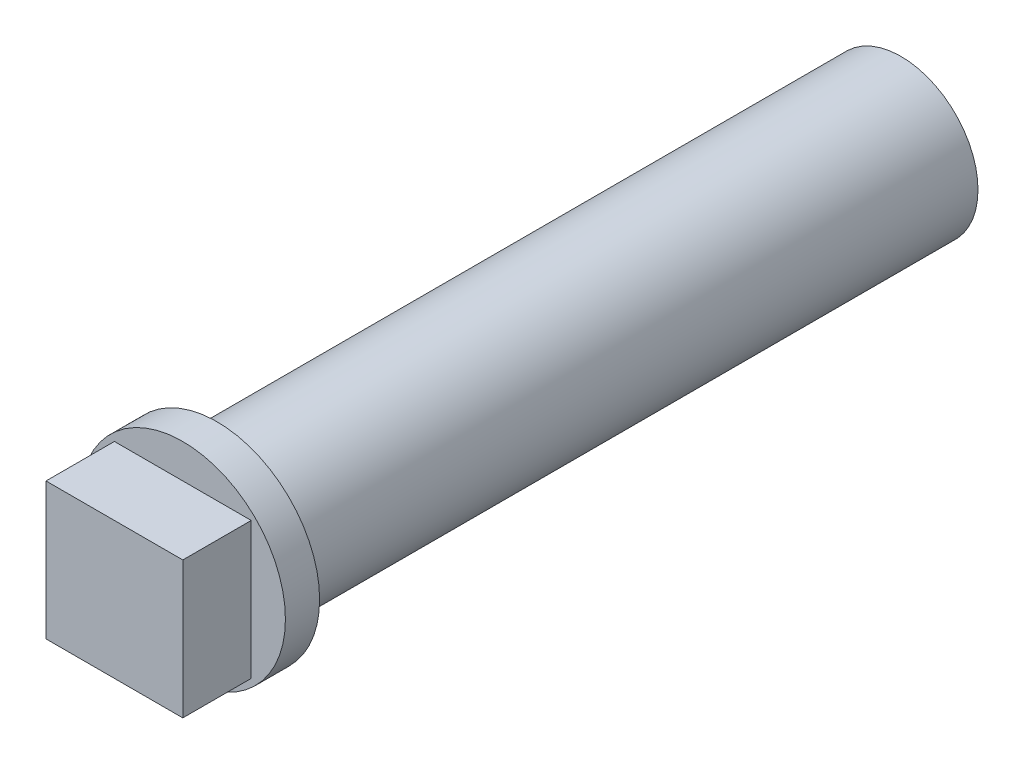
ISO-10303-21;
HEADER;
FILE_DESCRIPTION(('STEP AP214'),'2;1');
FILE_NAME('part.step','',(''),(''),'','','');
FILE_SCHEMA(('AUTOMOTIVE_DESIGN { 1 0 10303 214 1 1 1 1 }'));
ENDSEC;
DATA;
#1=APPLICATION_CONTEXT('core data for automotive mechanical design processes');
#2=APPLICATION_PROTOCOL_DEFINITION('international standard','automotive_design',2000,#1);
#3=PRODUCT_CONTEXT('',#1,'mechanical');
#4=PRODUCT('Part','Part','',(#3));
#5=PRODUCT_RELATED_PRODUCT_CATEGORY('part','',(#4));
#6=PRODUCT_DEFINITION_FORMATION('','',#4);
#7=PRODUCT_DEFINITION_CONTEXT('part definition',#1,'design');
#8=PRODUCT_DEFINITION('design','',#6,#7);
#9=PRODUCT_DEFINITION_SHAPE('','',#8);
#10=(LENGTH_UNIT() NAMED_UNIT(*) SI_UNIT(.MILLI.,.METRE.));
#11=(NAMED_UNIT(*) PLANE_ANGLE_UNIT() SI_UNIT($,.RADIAN.));
#12=(NAMED_UNIT(*) SI_UNIT($,.STERADIAN.) SOLID_ANGLE_UNIT());
#13=UNCERTAINTY_MEASURE_WITH_UNIT(LENGTH_MEASURE(1.E-05),#10,'distance_accuracy_value','');
#14=(GEOMETRIC_REPRESENTATION_CONTEXT(3) GLOBAL_UNCERTAINTY_ASSIGNED_CONTEXT((#13)) GLOBAL_UNIT_ASSIGNED_CONTEXT((#10,
#11,#12)) REPRESENTATION_CONTEXT('',''));
#15=CARTESIAN_POINT('',(0.,0.,0.));
#16=DIRECTION('',(0.,0.,1.));
#17=DIRECTION('',(1.,0.,0.));
#18=AXIS2_PLACEMENT_3D('',#15,#16,#17);
#19=CARTESIAN_POINT('',(0.,0.,20.));
#20=DIRECTION('',(0.,0.,-1.));
#21=DIRECTION('',(-1.,0.,0.));
#22=AXIS2_PLACEMENT_3D('',#19,#20,#21);
#23=CYLINDRICAL_SURFACE('',#22,2.25);
#24=CARTESIAN_POINT('',(0.,0.,20.));
#25=DIRECTION('',(0.,0.,1.));
#26=DIRECTION('',(1.,0.,0.));
#27=AXIS2_PLACEMENT_3D('',#24,#25,#26);
#28=CIRCLE('',#27,2.25);
#29=CARTESIAN_POINT('',(2.25,0.,20.));
#30=VERTEX_POINT('',#29);
#31=EDGE_CURVE('E11',#30,#30,#28,.T.);
#32=ORIENTED_EDGE('',*,*,#31,.F.);
#33=EDGE_LOOP('',(#32));
#34=FACE_BOUND('',#33,.T.);
#35=CARTESIAN_POINT('',(0.,0.,0.));
#36=DIRECTION('',(0.,0.,1.));
#37=DIRECTION('',(1.,0.,0.));
#38=AXIS2_PLACEMENT_3D('',#35,#36,#37);
#39=CIRCLE('',#38,2.25);
#40=CARTESIAN_POINT('',(2.25,0.,0.));
#41=VERTEX_POINT('',#40);
#42=EDGE_CURVE('E44',#41,#41,#39,.T.);
#43=ORIENTED_EDGE('',*,*,#42,.T.);
#44=EDGE_LOOP('',(#43));
#45=FACE_BOUND('',#44,.T.);
#46=ADVANCED_FACE('F41',(#34,#45),#23,.T.);
#47=CARTESIAN_POINT('',(0.,0.,0.));
#48=DIRECTION('',(0.,0.,1.));
#49=DIRECTION('',(1.,0.,0.));
#50=AXIS2_PLACEMENT_3D('',#47,#48,#49);
#51=PLANE('',#50);
#52=DIRECTION('',(-1.,0.,0.));
#53=VECTOR('',#52,1.);
#54=CARTESIAN_POINT('',(0.,-1.2,0.));
#55=LINE('',#54,#53);
#56=CARTESIAN_POINT('',(1.2,-1.2,0.));
#57=VERTEX_POINT('',#56);
#58=CARTESIAN_POINT('',(-1.2,-1.2,0.));
#59=VERTEX_POINT('',#58);
#60=EDGE_CURVE('E164',#57,#59,#55,.T.);
#61=ORIENTED_EDGE('',*,*,#60,.F.);
#62=DIRECTION('',(0.,-1.,0.));
#63=VECTOR('',#62,1.);
#64=CARTESIAN_POINT('',(1.2,0.,0.));
#65=LINE('',#64,#63);
#66=CARTESIAN_POINT('',(1.2,1.2,0.));
#67=VERTEX_POINT('',#66);
#68=EDGE_CURVE('E142',#67,#57,#65,.T.);
#69=ORIENTED_EDGE('',*,*,#68,.F.);
#70=DIRECTION('',(1.,0.,0.));
#71=VECTOR('',#70,1.);
#72=CARTESIAN_POINT('',(0.,1.2,0.));
#73=LINE('',#72,#71);
#74=CARTESIAN_POINT('',(-1.2,1.2,0.));
#75=VERTEX_POINT('',#74);
#76=EDGE_CURVE('E149',#75,#67,#73,.T.);
#77=ORIENTED_EDGE('',*,*,#76,.F.);
#78=DIRECTION('',(0.,1.,0.));
#79=VECTOR('',#78,1.);
#80=CARTESIAN_POINT('',(-1.2,0.,0.));
#81=LINE('',#80,#79);
#82=EDGE_CURVE('E168',#59,#75,#81,.T.);
#83=ORIENTED_EDGE('',*,*,#82,.F.);
#84=EDGE_LOOP('',(#61,#69,#77,#83));
#85=FACE_BOUND('',#84,.T.);
#86=ORIENTED_EDGE('',*,*,#42,.F.);
#87=EDGE_LOOP('',(#86));
#88=FACE_BOUND('',#87,.T.);
#89=ADVANCED_FACE('F195',(#85,#88),#51,.F.);
#90=CARTESIAN_POINT('',(1.2,0.,2.5));
#91=DIRECTION('',(1.,0.,0.));
#92=DIRECTION('',(0.,0.,-1.));
#93=AXIS2_PLACEMENT_3D('',#90,#91,#92);
#94=PLANE('',#93);
#95=ORIENTED_EDGE('',*,*,#68,.T.);
#96=DIRECTION('',(0.,0.,-1.));
#97=VECTOR('',#96,1.);
#98=CARTESIAN_POINT('',(1.2,-1.2,2.5));
#99=LINE('',#98,#97);
#100=CARTESIAN_POINT('',(1.2,-1.2,2.5));
#101=VERTEX_POINT('',#100);
#102=EDGE_CURVE('E161',#101,#57,#99,.T.);
#103=ORIENTED_EDGE('',*,*,#102,.F.);
#104=DIRECTION('',(0.,-1.,0.));
#105=VECTOR('',#104,1.);
#106=CARTESIAN_POINT('',(1.2,0.,2.5));
#107=LINE('',#106,#105);
#108=CARTESIAN_POINT('',(1.2,1.2,2.5));
#109=VERTEX_POINT('',#108);
#110=EDGE_CURVE('E144',#109,#101,#107,.T.);
#111=ORIENTED_EDGE('',*,*,#110,.F.);
#112=DIRECTION('',(0.,0.,-1.));
#113=VECTOR('',#112,1.);
#114=CARTESIAN_POINT('',(1.2,1.2,2.5));
#115=LINE('',#114,#113);
#116=EDGE_CURVE('E175',#109,#67,#115,.T.);
#117=ORIENTED_EDGE('',*,*,#116,.T.);
#118=EDGE_LOOP('',(#95,#103,#111,#117));
#119=FACE_BOUND('',#118,.T.);
#120=ADVANCED_FACE('F204',(#119),#94,.F.);
#121=CARTESIAN_POINT('',(0.,1.2,2.5));
#122=DIRECTION('',(0.,1.,0.));
#123=DIRECTION('',(-1.,0.,0.));
#124=AXIS2_PLACEMENT_3D('',#121,#122,#123);
#125=PLANE('',#124);
#126=ORIENTED_EDGE('',*,*,#76,.T.);
#127=ORIENTED_EDGE('',*,*,#116,.F.);
#128=DIRECTION('',(1.,0.,0.));
#129=VECTOR('',#128,1.);
#130=CARTESIAN_POINT('',(0.,1.2,2.5));
#131=LINE('',#130,#129);
#132=CARTESIAN_POINT('',(-1.2,1.2,2.5));
#133=VERTEX_POINT('',#132);
#134=EDGE_CURVE('E157',#133,#109,#131,.T.);
#135=ORIENTED_EDGE('',*,*,#134,.F.);
#136=DIRECTION('',(0.,0.,-1.));
#137=VECTOR('',#136,1.);
#138=CARTESIAN_POINT('',(-1.2,1.2,2.5));
#139=LINE('',#138,#137);
#140=EDGE_CURVE('E178',#133,#75,#139,.T.);
#141=ORIENTED_EDGE('',*,*,#140,.T.);
#142=EDGE_LOOP('',(#126,#127,#135,#141));
#143=FACE_BOUND('',#142,.T.);
#144=ADVANCED_FACE('F206',(#143),#125,.F.);
#145=CARTESIAN_POINT('',(-1.2,0.,2.5));
#146=DIRECTION('',(-1.,0.,0.));
#147=DIRECTION('',(0.,0.,1.));
#148=AXIS2_PLACEMENT_3D('',#145,#146,#147);
#149=PLANE('',#148);
#150=ORIENTED_EDGE('',*,*,#82,.T.);
#151=ORIENTED_EDGE('',*,*,#140,.F.);
#152=DIRECTION('',(0.,1.,0.));
#153=VECTOR('',#152,1.);
#154=CARTESIAN_POINT('',(-1.2,0.,2.5));
#155=LINE('',#154,#153);
#156=CARTESIAN_POINT('',(-1.2,-1.2,2.5));
#157=VERTEX_POINT('',#156);
#158=EDGE_CURVE('E153',#157,#133,#155,.T.);
#159=ORIENTED_EDGE('',*,*,#158,.F.);
#160=DIRECTION('',(0.,0.,-1.));
#161=VECTOR('',#160,1.);
#162=CARTESIAN_POINT('',(-1.2,-1.2,2.5));
#163=LINE('',#162,#161);
#164=EDGE_CURVE('E181',#157,#59,#163,.T.);
#165=ORIENTED_EDGE('',*,*,#164,.T.);
#166=EDGE_LOOP('',(#150,#151,#159,#165));
#167=FACE_BOUND('',#166,.T.);
#168=ADVANCED_FACE('F199',(#167),#149,.F.);
#169=CARTESIAN_POINT('',(0.,-1.2,2.5));
#170=DIRECTION('',(0.,-1.,0.));
#171=DIRECTION('',(1.,0.,0.));
#172=AXIS2_PLACEMENT_3D('',#169,#170,#171);
#173=PLANE('',#172);
#174=ORIENTED_EDGE('',*,*,#60,.T.);
#175=ORIENTED_EDGE('',*,*,#164,.F.);
#176=DIRECTION('',(-1.,0.,0.));
#177=VECTOR('',#176,1.);
#178=CARTESIAN_POINT('',(0.,-1.2,2.5));
#179=LINE('',#178,#177);
#180=EDGE_CURVE('E148',#101,#157,#179,.T.);
#181=ORIENTED_EDGE('',*,*,#180,.F.);
#182=ORIENTED_EDGE('',*,*,#102,.T.);
#183=EDGE_LOOP('',(#174,#175,#181,#182));
#184=FACE_BOUND('',#183,.T.);
#185=ADVANCED_FACE('F189',(#184),#173,.F.);
#186=CARTESIAN_POINT('',(0.,0.,2.5));
#187=DIRECTION('',(0.,0.,-1.));
#188=DIRECTION('',(-1.,0.,0.));
#189=AXIS2_PLACEMENT_3D('',#186,#187,#188);
#190=PLANE('',#189);
#191=ORIENTED_EDGE('',*,*,#110,.T.);
#192=ORIENTED_EDGE('',*,*,#180,.T.);
#193=ORIENTED_EDGE('',*,*,#158,.T.);
#194=ORIENTED_EDGE('',*,*,#134,.T.);
#195=EDGE_LOOP('',(#191,#192,#193,#194));
#196=FACE_BOUND('',#195,.T.);
#197=ADVANCED_FACE('F203',(#196),#190,.T.);
#198=CARTESIAN_POINT('',(0.,0.,21.));
#199=DIRECTION('',(0.,0.,-1.));
#200=DIRECTION('',(-1.,0.,0.));
#201=AXIS2_PLACEMENT_3D('',#198,#199,#200);
#202=CYLINDRICAL_SURFACE('',#201,3.);
#203=CARTESIAN_POINT('',(0.,0.,21.));
#204=DIRECTION('',(0.,0.,1.));
#205=DIRECTION('',(1.,0.,0.));
#206=AXIS2_PLACEMENT_3D('',#203,#204,#205);
#207=CIRCLE('',#206,3.);
#208=CARTESIAN_POINT('',(3.,0.,21.));
#209=VERTEX_POINT('',#208);
#210=EDGE_CURVE('E134',#209,#209,#207,.T.);
#211=ORIENTED_EDGE('',*,*,#210,.F.);
#212=EDGE_LOOP('',(#211));
#213=FACE_BOUND('',#212,.T.);
#214=CARTESIAN_POINT('',(0.,0.,20.));
#215=DIRECTION('',(0.,0.,1.));
#216=DIRECTION('',(1.,0.,0.));
#217=AXIS2_PLACEMENT_3D('',#214,#215,#216);
#218=CIRCLE('',#217,3.);
#219=CARTESIAN_POINT('',(3.,0.,20.));
#220=VERTEX_POINT('',#219);
#221=EDGE_CURVE('E129',#220,#220,#218,.T.);
#222=ORIENTED_EDGE('',*,*,#221,.T.);
#223=EDGE_LOOP('',(#222));
#224=FACE_BOUND('',#223,.T.);
#225=ADVANCED_FACE('F234',(#213,#224),#202,.T.);
#226=CARTESIAN_POINT('',(0.,0.,21.));
#227=DIRECTION('',(0.,0.,1.));
#228=DIRECTION('',(1.,0.,0.));
#229=AXIS2_PLACEMENT_3D('',#226,#227,#228);
#230=PLANE('',#229);
#231=DIRECTION('',(0.,-1.,0.));
#232=VECTOR('',#231,1.);
#233=CARTESIAN_POINT('',(-2.,-2.,21.));
#234=LINE('',#233,#232);
#235=CARTESIAN_POINT('',(-2.,2.,21.));
#236=VERTEX_POINT('',#235);
#237=CARTESIAN_POINT('',(-2.,-2.,21.));
#238=VERTEX_POINT('',#237);
#239=EDGE_CURVE('E56',#236,#238,#234,.T.);
#240=ORIENTED_EDGE('',*,*,#239,.F.);
#241=DIRECTION('',(-1.,0.,0.));
#242=VECTOR('',#241,1.);
#243=CARTESIAN_POINT('',(2.,2.,21.));
#244=LINE('',#243,#242);
#245=CARTESIAN_POINT('',(2.,2.,21.));
#246=VERTEX_POINT('',#245);
#247=EDGE_CURVE('E60',#246,#236,#244,.T.);
#248=ORIENTED_EDGE('',*,*,#247,.F.);
#249=DIRECTION('',(0.,1.,0.));
#250=VECTOR('',#249,1.);
#251=CARTESIAN_POINT('',(2.,-2.,21.));
#252=LINE('',#251,#250);
#253=CARTESIAN_POINT('',(2.,-2.,21.));
#254=VERTEX_POINT('',#253);
#255=EDGE_CURVE('E348',#254,#246,#252,.T.);
#256=ORIENTED_EDGE('',*,*,#255,.F.);
#257=DIRECTION('',(1.,0.,0.));
#258=VECTOR('',#257,1.);
#259=CARTESIAN_POINT('',(2.,-2.,21.));
#260=LINE('',#259,#258);
#261=EDGE_CURVE('E358',#238,#254,#260,.T.);
#262=ORIENTED_EDGE('',*,*,#261,.F.);
#263=EDGE_LOOP('',(#240,#248,#256,#262));
#264=FACE_BOUND('',#263,.T.);
#265=ORIENTED_EDGE('',*,*,#210,.T.);
#266=EDGE_LOOP('',(#265));
#267=FACE_BOUND('',#266,.T.);
#268=ADVANCED_FACE('F230',(#264,#267),#230,.T.);
#269=CARTESIAN_POINT('',(0.,0.,20.));
#270=DIRECTION('',(0.,0.,1.));
#271=DIRECTION('',(1.,0.,0.));
#272=AXIS2_PLACEMENT_3D('',#269,#270,#271);
#273=PLANE('',#272);
#274=ORIENTED_EDGE('',*,*,#31,.T.);
#275=EDGE_LOOP('',(#274));
#276=FACE_BOUND('',#275,.T.);
#277=ORIENTED_EDGE('',*,*,#221,.F.);
#278=EDGE_LOOP('',(#277));
#279=FACE_BOUND('',#278,.T.);
#280=ADVANCED_FACE('F227',(#276,#279),#273,.F.);
#281=CARTESIAN_POINT('',(-2.,-2.,23.));
#282=DIRECTION('',(1.,0.,0.));
#283=DIRECTION('',(0.,0.,-1.));
#284=AXIS2_PLACEMENT_3D('',#281,#282,#283);
#285=PLANE('',#284);
#286=ORIENTED_EDGE('',*,*,#239,.T.);
#287=DIRECTION('',(0.,0.,-1.));
#288=VECTOR('',#287,1.);
#289=CARTESIAN_POINT('',(-2.,-2.,23.));
#290=LINE('',#289,#288);
#291=CARTESIAN_POINT('',(-2.,-2.,23.));
#292=VERTEX_POINT('',#291);
#293=EDGE_CURVE('E109',#292,#238,#290,.T.);
#294=ORIENTED_EDGE('',*,*,#293,.F.);
#295=DIRECTION('',(0.,-1.,0.));
#296=VECTOR('',#295,1.);
#297=CARTESIAN_POINT('',(-2.,-2.,23.));
#298=LINE('',#297,#296);
#299=CARTESIAN_POINT('',(-2.,2.,23.));
#300=VERTEX_POINT('',#299);
#301=EDGE_CURVE('E116',#300,#292,#298,.T.);
#302=ORIENTED_EDGE('',*,*,#301,.F.);
#303=DIRECTION('',(0.,0.,-1.));
#304=VECTOR('',#303,1.);
#305=CARTESIAN_POINT('',(-2.,2.,23.));
#306=LINE('',#305,#304);
#307=EDGE_CURVE('E345',#300,#236,#306,.T.);
#308=ORIENTED_EDGE('',*,*,#307,.T.);
#309=EDGE_LOOP('',(#286,#294,#302,#308));
#310=FACE_BOUND('',#309,.T.);
#311=ADVANCED_FACE('F127',(#310),#285,.F.);
#312=CARTESIAN_POINT('',(2.,-2.,23.));
#313=DIRECTION('',(0.,1.,0.));
#314=DIRECTION('',(-1.,0.,0.));
#315=AXIS2_PLACEMENT_3D('',#312,#313,#314);
#316=PLANE('',#315);
#317=ORIENTED_EDGE('',*,*,#261,.T.);
#318=DIRECTION('',(0.,0.,-1.));
#319=VECTOR('',#318,1.);
#320=CARTESIAN_POINT('',(2.,-2.,23.));
#321=LINE('',#320,#319);
#322=CARTESIAN_POINT('',(2.,-2.,23.));
#323=VERTEX_POINT('',#322);
#324=EDGE_CURVE('E111',#323,#254,#321,.T.);
#325=ORIENTED_EDGE('',*,*,#324,.F.);
#326=DIRECTION('',(1.,0.,0.));
#327=VECTOR('',#326,1.);
#328=CARTESIAN_POINT('',(2.,-2.,23.));
#329=LINE('',#328,#327);
#330=EDGE_CURVE('E104',#292,#323,#329,.T.);
#331=ORIENTED_EDGE('',*,*,#330,.F.);
#332=ORIENTED_EDGE('',*,*,#293,.T.);
#333=EDGE_LOOP('',(#317,#325,#331,#332));
#334=FACE_BOUND('',#333,.T.);
#335=ADVANCED_FACE('F107',(#334),#316,.F.);
#336=CARTESIAN_POINT('',(2.,-2.,23.));
#337=DIRECTION('',(-1.,0.,0.));
#338=DIRECTION('',(0.,-1.,0.));
#339=AXIS2_PLACEMENT_3D('',#336,#337,#338);
#340=PLANE('',#339);
#341=ORIENTED_EDGE('',*,*,#255,.T.);
#342=DIRECTION('',(0.,0.,-1.));
#343=VECTOR('',#342,1.);
#344=CARTESIAN_POINT('',(2.,2.,23.));
#345=LINE('',#344,#343);
#346=CARTESIAN_POINT('',(2.,2.,23.));
#347=VERTEX_POINT('',#346);
#348=EDGE_CURVE('E136',#347,#246,#345,.T.);
#349=ORIENTED_EDGE('',*,*,#348,.F.);
#350=DIRECTION('',(0.,1.,0.));
#351=VECTOR('',#350,1.);
#352=CARTESIAN_POINT('',(2.,-2.,23.));
#353=LINE('',#352,#351);
#354=EDGE_CURVE('E115',#323,#347,#353,.T.);
#355=ORIENTED_EDGE('',*,*,#354,.F.);
#356=ORIENTED_EDGE('',*,*,#324,.T.);
#357=EDGE_LOOP('',(#341,#349,#355,#356));
#358=FACE_BOUND('',#357,.T.);
#359=ADVANCED_FACE('F249',(#358),#340,.F.);
#360=CARTESIAN_POINT('',(2.,2.,23.));
#361=DIRECTION('',(0.,-1.,0.));
#362=DIRECTION('',(1.,0.,0.));
#363=AXIS2_PLACEMENT_3D('',#360,#361,#362);
#364=PLANE('',#363);
#365=ORIENTED_EDGE('',*,*,#247,.T.);
#366=ORIENTED_EDGE('',*,*,#307,.F.);
#367=DIRECTION('',(-1.,0.,0.));
#368=VECTOR('',#367,1.);
#369=CARTESIAN_POINT('',(2.,2.,23.));
#370=LINE('',#369,#368);
#371=EDGE_CURVE('E121',#347,#300,#370,.T.);
#372=ORIENTED_EDGE('',*,*,#371,.F.);
#373=ORIENTED_EDGE('',*,*,#348,.T.);
#374=EDGE_LOOP('',(#365,#366,#372,#373));
#375=FACE_BOUND('',#374,.T.);
#376=ADVANCED_FACE('F252',(#375),#364,.F.);
#377=CARTESIAN_POINT('',(0.,0.,23.));
#378=DIRECTION('',(0.,0.,1.));
#379=DIRECTION('',(1.,0.,0.));
#380=AXIS2_PLACEMENT_3D('',#377,#378,#379);
#381=PLANE('',#380);
#382=ORIENTED_EDGE('',*,*,#301,.T.);
#383=ORIENTED_EDGE('',*,*,#330,.T.);
#384=ORIENTED_EDGE('',*,*,#354,.T.);
#385=ORIENTED_EDGE('',*,*,#371,.T.);
#386=EDGE_LOOP('',(#382,#383,#384,#385));
#387=FACE_BOUND('',#386,.T.);
#388=ADVANCED_FACE('F119',(#387),#381,.T.);
#389=CLOSED_SHELL('',(#46,#89,#120,#144,#168,#185,#197,#225,#268,#280,#311,#335,#359,#376,#388));
#390=MANIFOLD_SOLID_BREP('B2',#389);
#391=ADVANCED_BREP_SHAPE_REPRESENTATION('',(#18,#390),#14);
#392=SHAPE_DEFINITION_REPRESENTATION(#9,#391);
ENDSEC;
END-ISO-10303-21;
